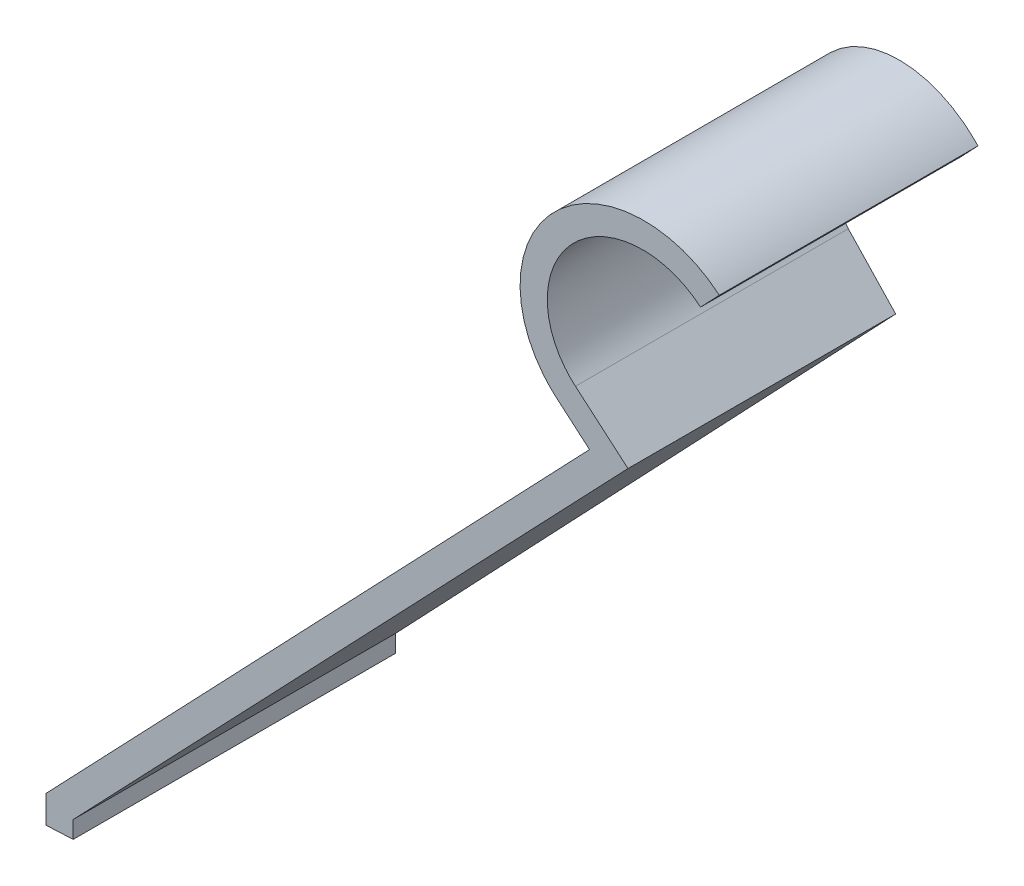
ISO-10303-21;
HEADER;
FILE_DESCRIPTION(('STEP AP214'),'2;1');
FILE_NAME('part.step','',(''),(''),'','','');
FILE_SCHEMA(('AUTOMOTIVE_DESIGN { 1 0 10303 214 1 1 1 1 }'));
ENDSEC;
DATA;
#1=APPLICATION_CONTEXT('core data for automotive mechanical design processes');
#2=APPLICATION_PROTOCOL_DEFINITION('international standard','automotive_design',2000,#1);
#3=PRODUCT_CONTEXT('',#1,'mechanical');
#4=PRODUCT('Part','Part','',(#3));
#5=PRODUCT_RELATED_PRODUCT_CATEGORY('part','',(#4));
#6=PRODUCT_DEFINITION_FORMATION('','',#4);
#7=PRODUCT_DEFINITION_CONTEXT('part definition',#1,'design');
#8=PRODUCT_DEFINITION('design','',#6,#7);
#9=PRODUCT_DEFINITION_SHAPE('','',#8);
#10=(LENGTH_UNIT() NAMED_UNIT(*) SI_UNIT(.MILLI.,.METRE.));
#11=(NAMED_UNIT(*) PLANE_ANGLE_UNIT() SI_UNIT($,.RADIAN.));
#12=(NAMED_UNIT(*) SI_UNIT($,.STERADIAN.) SOLID_ANGLE_UNIT());
#13=UNCERTAINTY_MEASURE_WITH_UNIT(LENGTH_MEASURE(1.E-05),#10,'distance_accuracy_value','');
#14=(GEOMETRIC_REPRESENTATION_CONTEXT(3) GLOBAL_UNCERTAINTY_ASSIGNED_CONTEXT((#13)) GLOBAL_UNIT_ASSIGNED_CONTEXT((#10,
#11,#12)) REPRESENTATION_CONTEXT('',''));
#15=CARTESIAN_POINT('',(0.,0.,0.));
#16=DIRECTION('',(0.,0.,1.));
#17=DIRECTION('',(1.,0.,0.));
#18=AXIS2_PLACEMENT_3D('',#15,#16,#17);
#19=CARTESIAN_POINT('',(-0.3,0.32,-2.));
#20=DIRECTION('',(-0.72424915021225,0.689538373418648,0.));
#21=DIRECTION('',(-0.689538373418648,-0.72424915021225,0.));
#22=AXIS2_PLACEMENT_3D('',#19,#20,#21);
#23=PLANE('',#22);
#24=DIRECTION('',(0.,0.,1.));
#25=VECTOR('',#24,1.);
#26=CARTESIAN_POINT('',(5.69207113981391,6.61370691801474,-2.));
#27=LINE('',#26,#25);
#28=CARTESIAN_POINT('',(5.69207113981391,6.61370691801474,-1.57420568149214));
#29=VERTEX_POINT('',#28);
#30=CARTESIAN_POINT('',(5.69207113981391,6.61370691801474,1.57420568149214));
#31=VERTEX_POINT('',#30);
#32=EDGE_CURVE('E11',#29,#31,#27,.T.);
#33=ORIENTED_EDGE('',*,*,#32,.F.);
#34=DIRECTION('',(-0.689097797094574,-0.723786395649756,-0.0357418453880249));
#35=VECTOR('',#34,1.);
#36=CARTESIAN_POINT('',(-0.302832407095913,0.317025011933564,-1.88514691014385));
#37=LINE('',#36,#35);
#38=CARTESIAN_POINT('',(-0.3,0.32,-1.885));
#39=VERTEX_POINT('',#38);
#40=EDGE_CURVE('E153',#29,#39,#37,.T.);
#41=ORIENTED_EDGE('',*,*,#40,.T.);
#42=DIRECTION('',(0.,0.,1.));
#43=VECTOR('',#42,1.);
#44=CARTESIAN_POINT('',(-0.3,0.32,-2.));
#45=LINE('',#44,#43);
#46=CARTESIAN_POINT('',(-0.3,0.32,1.885));
#47=VERTEX_POINT('',#46);
#48=EDGE_CURVE('E19',#39,#47,#45,.T.);
#49=ORIENTED_EDGE('',*,*,#48,.T.);
#50=DIRECTION('',(0.689097797094574,0.723786395649756,-0.0357418453880251));
#51=VECTOR('',#50,1.);
#52=CARTESIAN_POINT('',(-0.204313899411981,0.420502857722642,1.88003699209688));
#53=LINE('',#52,#51);
#54=EDGE_CURVE('E127',#47,#31,#53,.T.);
#55=ORIENTED_EDGE('',*,*,#54,.T.);
#56=EDGE_LOOP('',(#33,#41,#49,#55));
#57=FACE_BOUND('',#56,.T.);
#58=ADVANCED_FACE('F16',(#57),#23,.T.);
#59=CARTESIAN_POINT('',(5.32994656470778,6.95847610472408,-2.));
#60=DIRECTION('',(-0.689538373418647,-0.72424915021225,0.));
#61=DIRECTION('',(0.72424915021225,-0.689538373418647,0.));
#62=AXIS2_PLACEMENT_3D('',#59,#60,#61);
#63=PLANE('',#62);
#64=DIRECTION('',(0.,0.,1.));
#65=VECTOR('',#64,1.);
#66=CARTESIAN_POINT('',(5.32994656470778,6.95847610472408,-2.));
#67=LINE('',#66,#65);
#68=CARTESIAN_POINT('',(5.32994656470778,6.95847610472408,-1.59298821225805));
#69=VERTEX_POINT('',#68);
#70=CARTESIAN_POINT('',(5.32994656470778,6.95847610472408,1.59298821225805));
#71=VERTEX_POINT('',#70);
#72=EDGE_CURVE('E24',#69,#71,#67,.T.);
#73=ORIENTED_EDGE('',*,*,#72,.F.);
#74=DIRECTION('',(0.723738684155627,-0.689052372248655,0.0375385848851769));
#75=VECTOR('',#74,1.);
#76=CARTESIAN_POINT('',(5.31888881716276,6.96900389236957,-1.59356175102825));
#77=LINE('',#76,#75);
#78=EDGE_CURVE('E155',#69,#29,#77,.T.);
#79=ORIENTED_EDGE('',*,*,#78,.T.);
#80=ORIENTED_EDGE('',*,*,#32,.T.);
#81=DIRECTION('',(-0.723738684155627,0.689052372248655,0.037538584885177));
#82=VECTOR('',#81,1.);
#83=CARTESIAN_POINT('',(5.42756132128221,6.86553968850561,1.58792516960752));
#84=LINE('',#83,#82);
#85=EDGE_CURVE('E129',#31,#71,#84,.T.);
#86=ORIENTED_EDGE('',*,*,#85,.T.);
#87=EDGE_LOOP('',(#73,#79,#80,#86));
#88=FACE_BOUND('',#87,.T.);
#89=ADVANCED_FACE('F177',(#88),#63,.T.);
#90=CARTESIAN_POINT('',(6.22634645015202,7.9,-2.));
#91=DIRECTION('',(0.,0.,1.));
#92=DIRECTION('',(1.,0.,0.));
#93=AXIS2_PLACEMENT_3D('',#90,#91,#92);
#94=CYLINDRICAL_SURFACE('',#93,1.3);
#95=DIRECTION('',(0.,0.,1.));
#96=VECTOR('',#95,1.);
#97=CARTESIAN_POINT('',(7.12274633559626,8.84152389527593,-2.));
#98=LINE('',#97,#96);
#99=CARTESIAN_POINT('',(7.12274633559626,8.84152389527592,-1.5));
#100=VERTEX_POINT('',#99);
#101=CARTESIAN_POINT('',(7.12274633559626,8.84152389527593,1.5));
#102=VERTEX_POINT('',#101);
#103=EDGE_CURVE('E124',#100,#102,#98,.T.);
#104=ORIENTED_EDGE('',*,*,#103,.F.);
#105=CARTESIAN_POINT('',(6.22634645015202,7.9,-1.54649410612903));
#106=DIRECTION('',(0.0517979670271859,0.,-0.998657584265924));
#107=DIRECTION('',(0.998657584265924,0.,0.0517979670271859));
#108=AXIS2_PLACEMENT_3D('',#105,#106,#107);
#109=ELLIPSE('',#108,1.30174748630741,1.3);
#110=EDGE_CURVE('E158',#100,#69,#109,.F.);
#111=ORIENTED_EDGE('',*,*,#110,.T.);
#112=ORIENTED_EDGE('',*,*,#72,.T.);
#113=CARTESIAN_POINT('',(6.22634645015202,7.9,1.54649410612903));
#114=DIRECTION('',(0.0517979670271861,0.,0.998657584265924));
#115=DIRECTION('',(-0.998657584265924,0.,0.0517979670271861));
#116=AXIS2_PLACEMENT_3D('',#113,#114,#115);
#117=ELLIPSE('',#116,1.30174748630741,1.3);
#118=EDGE_CURVE('E132',#71,#102,#117,.F.);
#119=ORIENTED_EDGE('',*,*,#118,.T.);
#120=EDGE_LOOP('',(#104,#111,#112,#119));
#121=FACE_BOUND('',#120,.T.);
#122=ADVANCED_FACE('F185',(#121),#94,.T.);
#123=CARTESIAN_POINT('',(6.91588482357067,8.62424915021225,-2.));
#124=DIRECTION('',(0.72424915021225,-0.689538373418647,0.));
#125=DIRECTION('',(0.689538373418647,0.72424915021225,0.));
#126=AXIS2_PLACEMENT_3D('',#123,#124,#125);
#127=PLANE('',#126);
#128=DIRECTION('',(0.,0.,1.));
#129=VECTOR('',#128,1.);
#130=CARTESIAN_POINT('',(6.91588482357067,8.62424915021225,-2.));
#131=LINE('',#130,#129);
#132=CARTESIAN_POINT('',(6.91588482357067,8.62424915021225,-1.5107294091067));
#133=VERTEX_POINT('',#132);
#134=CARTESIAN_POINT('',(6.91588482357067,8.62424915021225,1.5107294091067));
#135=VERTEX_POINT('',#134);
#136=EDGE_CURVE('E122',#133,#135,#131,.T.);
#137=ORIENTED_EDGE('',*,*,#136,.F.);
#138=DIRECTION('',(0.689097797094573,0.723786395649756,0.0357418453880249));
#139=VECTOR('',#138,1.);
#140=CARTESIAN_POINT('',(6.90383427145356,8.61159198352385,-1.51135444226226));
#141=LINE('',#140,#139);
#142=EDGE_CURVE('E160',#133,#100,#141,.T.);
#143=ORIENTED_EDGE('',*,*,#142,.T.);
#144=ORIENTED_EDGE('',*,*,#103,.T.);
#145=DIRECTION('',(-0.689097797094573,-0.723786395649756,0.0357418453880251));
#146=VECTOR('',#145,1.);
#147=CARTESIAN_POINT('',(7.00235277913749,8.71506982931293,1.5062445242153));
#148=LINE('',#147,#146);
#149=EDGE_CURVE('E135',#102,#135,#148,.T.);
#150=ORIENTED_EDGE('',*,*,#149,.T.);
#151=EDGE_LOOP('',(#137,#143,#144,#150));
#152=FACE_BOUND('',#151,.T.);
#153=ADVANCED_FACE('F188',(#152),#127,.T.);
#154=CARTESIAN_POINT('',(6.22634645015202,7.9,-2.));
#155=DIRECTION('',(0.,0.,1.));
#156=DIRECTION('',(1.,0.,0.));
#157=AXIS2_PLACEMENT_3D('',#154,#155,#156);
#158=CYLINDRICAL_SURFACE('',#157,1.);
#159=DIRECTION('',(0.,0.,1.));
#160=VECTOR('',#159,1.);
#161=CARTESIAN_POINT('',(5.53680807673337,7.17575084978775,-2.));
#162=LINE('',#161,#160);
#163=CARTESIAN_POINT('',(5.53680807673337,7.17575084978775,-1.58225880315135));
#164=VERTEX_POINT('',#163);
#165=CARTESIAN_POINT('',(5.53680807673337,7.17575084978775,1.58225880315135));
#166=VERTEX_POINT('',#165);
#167=EDGE_CURVE('E120',#164,#166,#162,.T.);
#168=ORIENTED_EDGE('',*,*,#167,.F.);
#169=CARTESIAN_POINT('',(6.22634645015202,7.9,-1.54649410612903));
#170=DIRECTION('',(0.0517979670271859,0.,-0.998657584265924));
#171=DIRECTION('',(0.998657584265924,0.,0.0517979670271859));
#172=AXIS2_PLACEMENT_3D('',#169,#170,#171);
#173=ELLIPSE('',#172,1.00134422023647,1.);
#174=EDGE_CURVE('E163',#164,#133,#173,.T.);
#175=ORIENTED_EDGE('',*,*,#174,.T.);
#176=ORIENTED_EDGE('',*,*,#136,.T.);
#177=CARTESIAN_POINT('',(6.22634645015202,7.9,1.54649410612903));
#178=DIRECTION('',(0.0517979670271861,0.,0.998657584265924));
#179=DIRECTION('',(-0.998657584265924,0.,0.0517979670271861));
#180=AXIS2_PLACEMENT_3D('',#177,#178,#179);
#181=ELLIPSE('',#180,1.00134422023647,1.);
#182=EDGE_CURVE('E138',#135,#166,#181,.T.);
#183=ORIENTED_EDGE('',*,*,#182,.T.);
#184=EDGE_LOOP('',(#168,#175,#176,#183));
#185=FACE_BOUND('',#184,.T.);
#186=ADVANCED_FACE('F191',(#185),#158,.F.);
#187=CARTESIAN_POINT('',(5.53680807673337,7.17575084978775,-2.));
#188=DIRECTION('',(0.689538373418645,0.724249150212252,0.));
#189=DIRECTION('',(-0.724249150212252,0.689538373418645,0.));
#190=AXIS2_PLACEMENT_3D('',#187,#188,#189);
#191=PLANE('',#190);
#192=DIRECTION('',(0.,0.,1.));
#193=VECTOR('',#192,1.);
#194=CARTESIAN_POINT('',(6.11620739690317,6.62412015105284,-2.));
#195=LINE('',#194,#193);
#196=CARTESIAN_POINT('',(6.11620739690317,6.62412015105283,-1.5522067539259));
#197=VERTEX_POINT('',#196);
#198=CARTESIAN_POINT('',(6.11620739690317,6.62412015105284,1.5522067539259));
#199=VERTEX_POINT('',#198);
#200=EDGE_CURVE('E116',#197,#199,#195,.T.);
#201=ORIENTED_EDGE('',*,*,#200,.F.);
#202=DIRECTION('',(-0.72373868415563,0.689052372248653,-0.037538584885177));
#203=VECTOR('',#202,1.);
#204=CARTESIAN_POINT('',(5.52545883124952,7.18655616487603,-1.58284746121856));
#205=LINE('',#204,#203);
#206=EDGE_CURVE('E166',#197,#164,#205,.T.);
#207=ORIENTED_EDGE('',*,*,#206,.T.);
#208=ORIENTED_EDGE('',*,*,#167,.T.);
#209=DIRECTION('',(0.72373868415563,-0.689052372248653,-0.0375385848851771));
#210=VECTOR('',#209,1.);
#211=CARTESIAN_POINT('',(5.63413133536897,7.08309196101208,1.57721087979783));
#212=LINE('',#211,#210);
#213=EDGE_CURVE('E141',#166,#199,#212,.T.);
#214=ORIENTED_EDGE('',*,*,#213,.T.);
#215=EDGE_LOOP('',(#201,#207,#208,#214));
#216=FACE_BOUND('',#215,.T.);
#217=ADVANCED_FACE('F196',(#216),#191,.T.);
#218=CARTESIAN_POINT('',(0.,0.200028062069752,-2.));
#219=DIRECTION('',(0.72424915021225,-0.689538373418648,0.));
#220=DIRECTION('',(0.689538373418648,0.72424915021225,0.));
#221=AXIS2_PLACEMENT_3D('',#218,#219,#220);
#222=PLANE('',#221);
#223=DIRECTION('',(0.,0.,1.));
#224=VECTOR('',#223,1.);
#225=CARTESIAN_POINT('',(0.,0.200028062069752,-2.));
#226=LINE('',#225,#224);
#227=CARTESIAN_POINT('',(0.,0.200028062069752,-1.8694397215292));
#228=VERTEX_POINT('',#227);
#229=CARTESIAN_POINT('',(0.,0.200028062069752,1.8694397215292));
#230=VERTEX_POINT('',#229);
#231=EDGE_CURVE('E114',#228,#230,#226,.T.);
#232=ORIENTED_EDGE('',*,*,#231,.F.);
#233=DIRECTION('',(0.689097797094574,0.723786395649756,0.0357418453880249));
#234=VECTOR('',#233,1.);
#235=CARTESIAN_POINT('',(-0.0032156509494355,0.196650537979306,-1.86960650960999));
#236=LINE('',#235,#234);
#237=EDGE_CURVE('E96',#228,#197,#236,.T.);
#238=ORIENTED_EDGE('',*,*,#237,.T.);
#239=ORIENTED_EDGE('',*,*,#200,.T.);
#240=DIRECTION('',(-0.689097797094574,-0.723786395649756,0.0357418453880251));
#241=VECTOR('',#240,1.);
#242=CARTESIAN_POINT('',(0.0953028567344962,0.300128383768385,1.86449659156303));
#243=LINE('',#242,#241);
#244=EDGE_CURVE('E144',#199,#230,#243,.T.);
#245=ORIENTED_EDGE('',*,*,#244,.T.);
#246=EDGE_LOOP('',(#232,#238,#239,#245));
#247=FACE_BOUND('',#246,.T.);
#248=ADVANCED_FACE('F198',(#247),#222,.T.);
#249=CARTESIAN_POINT('',(0.,0.,-2.));
#250=DIRECTION('',(1.,0.,0.));
#251=DIRECTION('',(0.,1.,0.));
#252=AXIS2_PLACEMENT_3D('',#249,#250,#251);
#253=PLANE('',#252);
#254=DIRECTION('',(0.,0.,1.));
#255=VECTOR('',#254,1.);
#256=CARTESIAN_POINT('',(0.,0.,-2.));
#257=LINE('',#256,#255);
#258=CARTESIAN_POINT('',(0.,0.,-1.8694397215292));
#259=VERTEX_POINT('',#258);
#260=CARTESIAN_POINT('',(0.,0.,1.8694397215292));
#261=VERTEX_POINT('',#260);
#262=EDGE_CURVE('E106',#259,#261,#257,.T.);
#263=ORIENTED_EDGE('',*,*,#262,.F.);
#264=DIRECTION('',(0.,1.,0.));
#265=VECTOR('',#264,1.);
#266=CARTESIAN_POINT('',(0.,0.,-1.8694397215292));
#267=LINE('',#266,#265);
#268=EDGE_CURVE('E92',#259,#228,#267,.T.);
#269=ORIENTED_EDGE('',*,*,#268,.T.);
#270=ORIENTED_EDGE('',*,*,#231,.T.);
#271=DIRECTION('',(0.,-1.,0.));
#272=VECTOR('',#271,1.);
#273=CARTESIAN_POINT('',(0.,0.,1.8694397215292));
#274=LINE('',#273,#272);
#275=EDGE_CURVE('E113',#230,#261,#274,.T.);
#276=ORIENTED_EDGE('',*,*,#275,.T.);
#277=EDGE_LOOP('',(#263,#269,#270,#276));
#278=FACE_BOUND('',#277,.T.);
#279=ADVANCED_FACE('F111',(#278),#253,.T.);
#280=CARTESIAN_POINT('',(-0.3,0.,-2.));
#281=DIRECTION('',(0.,-1.,0.));
#282=DIRECTION('',(0.,0.,-1.));
#283=AXIS2_PLACEMENT_3D('',#280,#281,#282);
#284=PLANE('',#283);
#285=DIRECTION('',(0.,0.,1.));
#286=VECTOR('',#285,1.);
#287=CARTESIAN_POINT('',(-0.3,0.,-2.));
#288=LINE('',#287,#286);
#289=CARTESIAN_POINT('',(-0.3,0.,-1.885));
#290=VERTEX_POINT('',#289);
#291=CARTESIAN_POINT('',(-0.3,0.,1.885));
#292=VERTEX_POINT('',#291);
#293=EDGE_CURVE('E108',#290,#292,#288,.T.);
#294=ORIENTED_EDGE('',*,*,#293,.F.);
#295=DIRECTION('',(0.998657584265924,0.,0.0517979670271859));
#296=VECTOR('',#295,1.);
#297=CARTESIAN_POINT('',(7.12274633559626,0.,-1.5));
#298=LINE('',#297,#296);
#299=EDGE_CURVE('E32',#290,#259,#298,.T.);
#300=ORIENTED_EDGE('',*,*,#299,.T.);
#301=ORIENTED_EDGE('',*,*,#262,.T.);
#302=DIRECTION('',(-0.998657584265924,0.,0.0517979670271861));
#303=VECTOR('',#302,1.);
#304=CARTESIAN_POINT('',(7.12274633559626,0.,1.5));
#305=LINE('',#304,#303);
#306=EDGE_CURVE('E151',#261,#292,#305,.T.);
#307=ORIENTED_EDGE('',*,*,#306,.T.);
#308=EDGE_LOOP('',(#294,#300,#301,#307));
#309=FACE_BOUND('',#308,.T.);
#310=ADVANCED_FACE('F104',(#309),#284,.T.);
#311=CARTESIAN_POINT('',(-0.3,0.32,-2.));
#312=DIRECTION('',(-1.,0.,0.));
#313=DIRECTION('',(0.,0.,1.));
#314=AXIS2_PLACEMENT_3D('',#311,#312,#313);
#315=PLANE('',#314);
#316=ORIENTED_EDGE('',*,*,#48,.F.);
#317=DIRECTION('',(0.,-1.,0.));
#318=VECTOR('',#317,1.);
#319=CARTESIAN_POINT('',(-0.3,9.2,-1.885));
#320=LINE('',#319,#318);
#321=EDGE_CURVE('E100',#39,#290,#320,.T.);
#322=ORIENTED_EDGE('',*,*,#321,.T.);
#323=ORIENTED_EDGE('',*,*,#293,.T.);
#324=DIRECTION('',(0.,-1.,0.));
#325=VECTOR('',#324,1.);
#326=CARTESIAN_POINT('',(-0.3,9.2,1.885));
#327=LINE('',#326,#325);
#328=EDGE_CURVE('E148',#47,#292,#327,.T.);
#329=ORIENTED_EDGE('',*,*,#328,.F.);
#330=EDGE_LOOP('',(#316,#322,#323,#329));
#331=FACE_BOUND('',#330,.T.);
#332=ADVANCED_FACE('F171',(#331),#315,.T.);
#333=CARTESIAN_POINT('',(7.12274633559626,9.2,1.5));
#334=DIRECTION('',(0.0517979670271861,0.,0.998657584265924));
#335=DIRECTION('',(0.998657584265924,0.,-0.0517979670271861));
#336=AXIS2_PLACEMENT_3D('',#333,#334,#335);
#337=PLANE('',#336);
#338=ORIENTED_EDGE('',*,*,#328,.T.);
#339=ORIENTED_EDGE('',*,*,#306,.F.);
#340=ORIENTED_EDGE('',*,*,#275,.F.);
#341=ORIENTED_EDGE('',*,*,#244,.F.);
#342=ORIENTED_EDGE('',*,*,#213,.F.);
#343=ORIENTED_EDGE('',*,*,#182,.F.);
#344=ORIENTED_EDGE('',*,*,#149,.F.);
#345=ORIENTED_EDGE('',*,*,#118,.F.);
#346=ORIENTED_EDGE('',*,*,#85,.F.);
#347=ORIENTED_EDGE('',*,*,#54,.F.);
#348=EDGE_LOOP('',(#338,#339,#340,#341,#342,#343,#344,#345,#346,#347));
#349=FACE_BOUND('',#348,.T.);
#350=ADVANCED_FACE('F180',(#349),#337,.T.);
#351=CARTESIAN_POINT('',(7.12274633559626,9.2,-1.5));
#352=DIRECTION('',(0.0517979670271859,0.,-0.998657584265924));
#353=DIRECTION('',(-0.998657584265924,0.,-0.0517979670271859));
#354=AXIS2_PLACEMENT_3D('',#351,#352,#353);
#355=PLANE('',#354);
#356=ORIENTED_EDGE('',*,*,#78,.F.);
#357=ORIENTED_EDGE('',*,*,#110,.F.);
#358=ORIENTED_EDGE('',*,*,#142,.F.);
#359=ORIENTED_EDGE('',*,*,#174,.F.);
#360=ORIENTED_EDGE('',*,*,#206,.F.);
#361=ORIENTED_EDGE('',*,*,#237,.F.);
#362=ORIENTED_EDGE('',*,*,#268,.F.);
#363=ORIENTED_EDGE('',*,*,#299,.F.);
#364=ORIENTED_EDGE('',*,*,#321,.F.);
#365=ORIENTED_EDGE('',*,*,#40,.F.);
#366=EDGE_LOOP('',(#356,#357,#358,#359,#360,#361,#362,#363,#364,#365));
#367=FACE_BOUND('',#366,.T.);
#368=ADVANCED_FACE('F94',(#367),#355,.T.);
#369=CLOSED_SHELL('',(#58,#89,#122,#153,#186,#217,#248,#279,#310,#332,#350,#368));
#370=MANIFOLD_SOLID_BREP('B1',#369);
#371=ADVANCED_BREP_SHAPE_REPRESENTATION('',(#18,#370),#14);
#372=SHAPE_DEFINITION_REPRESENTATION(#9,#371);
ENDSEC;
END-ISO-10303-21;
